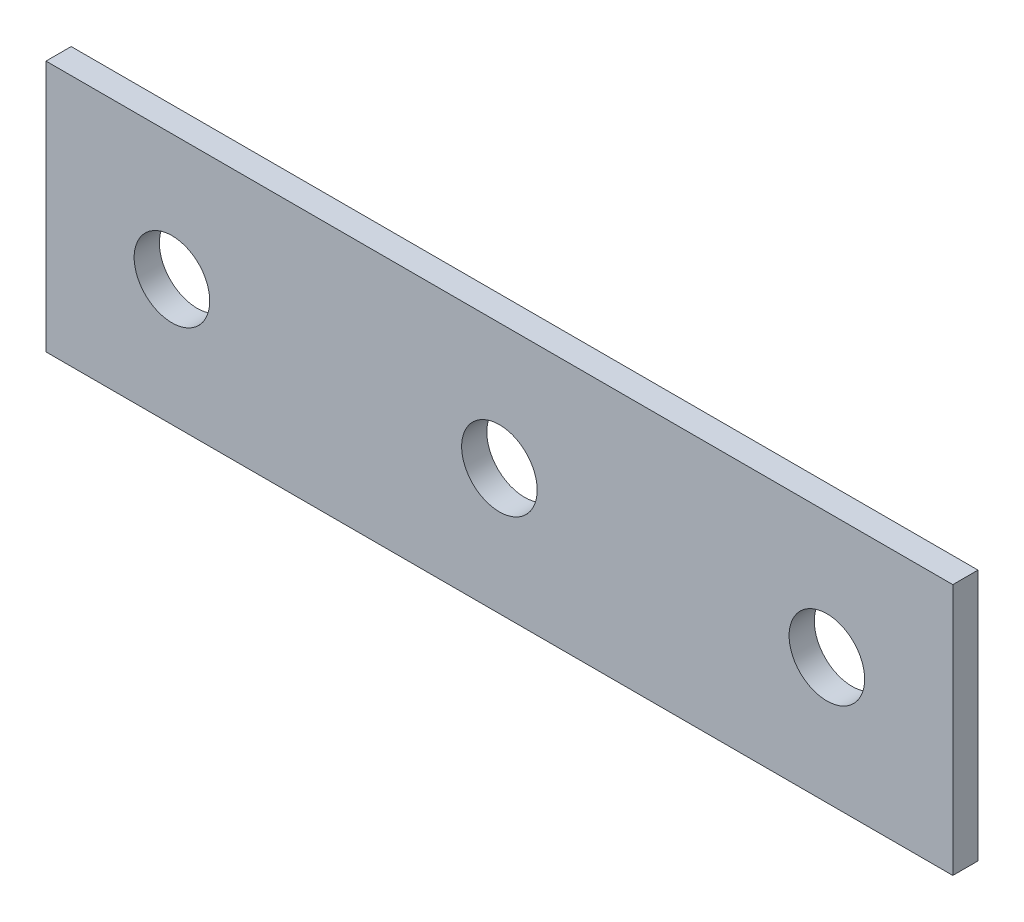
ISO-10303-21;
HEADER;
FILE_DESCRIPTION(('STEP AP214'),'2;1');
FILE_NAME('part.step','',(''),(''),'','','');
FILE_SCHEMA(('AUTOMOTIVE_DESIGN { 1 0 10303 214 1 1 1 1 }'));
ENDSEC;
DATA;
#1=APPLICATION_CONTEXT('core data for automotive mechanical design processes');
#2=APPLICATION_PROTOCOL_DEFINITION('international standard','automotive_design',2000,#1);
#3=PRODUCT_CONTEXT('',#1,'mechanical');
#4=PRODUCT('Part','Part','',(#3));
#5=PRODUCT_RELATED_PRODUCT_CATEGORY('part','',(#4));
#6=PRODUCT_DEFINITION_FORMATION('','',#4);
#7=PRODUCT_DEFINITION_CONTEXT('part definition',#1,'design');
#8=PRODUCT_DEFINITION('design','',#6,#7);
#9=PRODUCT_DEFINITION_SHAPE('','',#8);
#10=(LENGTH_UNIT() NAMED_UNIT(*) SI_UNIT(.MILLI.,.METRE.));
#11=(NAMED_UNIT(*) PLANE_ANGLE_UNIT() SI_UNIT($,.RADIAN.));
#12=(NAMED_UNIT(*) SI_UNIT($,.STERADIAN.) SOLID_ANGLE_UNIT());
#13=UNCERTAINTY_MEASURE_WITH_UNIT(LENGTH_MEASURE(1.E-05),#10,'distance_accuracy_value','');
#14=(GEOMETRIC_REPRESENTATION_CONTEXT(3) GLOBAL_UNCERTAINTY_ASSIGNED_CONTEXT((#13)) GLOBAL_UNIT_ASSIGNED_CONTEXT((#10,
#11,#12)) REPRESENTATION_CONTEXT('',''));
#15=CARTESIAN_POINT('',(0.,0.,0.));
#16=DIRECTION('',(0.,0.,1.));
#17=DIRECTION('',(1.,0.,0.));
#18=AXIS2_PLACEMENT_3D('',#15,#16,#17);
#19=CARTESIAN_POINT('',(114.3,-31.75,6.35));
#20=DIRECTION('',(-1.,0.,0.));
#21=DIRECTION('',(0.,0.,1.));
#22=AXIS2_PLACEMENT_3D('',#19,#20,#21);
#23=PLANE('',#22);
#24=DIRECTION('',(0.,1.,0.));
#25=VECTOR('',#24,1.);
#26=CARTESIAN_POINT('',(114.3,-31.75,0.));
#27=LINE('',#26,#25);
#28=CARTESIAN_POINT('',(114.3,-31.75,0.));
#29=VERTEX_POINT('',#28);
#30=CARTESIAN_POINT('',(114.3,31.75,0.));
#31=VERTEX_POINT('',#30);
#32=EDGE_CURVE('E102',#29,#31,#27,.T.);
#33=ORIENTED_EDGE('',*,*,#32,.T.);
#34=DIRECTION('',(0.,0.,-1.));
#35=VECTOR('',#34,1.);
#36=CARTESIAN_POINT('',(114.3,31.75,6.35));
#37=LINE('',#36,#35);
#38=CARTESIAN_POINT('',(114.3,31.75,6.35));
#39=VERTEX_POINT('',#38);
#40=EDGE_CURVE('E93',#39,#31,#37,.T.);
#41=ORIENTED_EDGE('',*,*,#40,.F.);
#42=DIRECTION('',(0.,1.,0.));
#43=VECTOR('',#42,1.);
#44=CARTESIAN_POINT('',(114.3,-31.75,6.35));
#45=LINE('',#44,#43);
#46=CARTESIAN_POINT('',(114.3,-31.75,6.35));
#47=VERTEX_POINT('',#46);
#48=EDGE_CURVE('E87',#47,#39,#45,.T.);
#49=ORIENTED_EDGE('',*,*,#48,.F.);
#50=DIRECTION('',(0.,0.,-1.));
#51=VECTOR('',#50,1.);
#52=CARTESIAN_POINT('',(114.3,-31.75,6.35));
#53=LINE('',#52,#51);
#54=EDGE_CURVE('E98',#47,#29,#53,.T.);
#55=ORIENTED_EDGE('',*,*,#54,.T.);
#56=EDGE_LOOP('',(#33,#41,#49,#55));
#57=FACE_BOUND('',#56,.T.);
#58=ADVANCED_FACE('F33',(#57),#23,.F.);
#59=CARTESIAN_POINT('',(-114.3,31.75,6.35));
#60=DIRECTION('',(0.,-1.,0.));
#61=DIRECTION('',(0.,0.,-1.));
#62=AXIS2_PLACEMENT_3D('',#59,#60,#61);
#63=PLANE('',#62);
#64=DIRECTION('',(-1.,0.,0.));
#65=VECTOR('',#64,1.);
#66=CARTESIAN_POINT('',(-114.3,31.75,0.));
#67=LINE('',#66,#65);
#68=CARTESIAN_POINT('',(-114.3,31.75,0.));
#69=VERTEX_POINT('',#68);
#70=EDGE_CURVE('E92',#31,#69,#67,.T.);
#71=ORIENTED_EDGE('',*,*,#70,.T.);
#72=DIRECTION('',(0.,0.,-1.));
#73=VECTOR('',#72,1.);
#74=CARTESIAN_POINT('',(-114.3,31.75,6.35));
#75=LINE('',#74,#73);
#76=CARTESIAN_POINT('',(-114.3,31.75,6.35));
#77=VERTEX_POINT('',#76);
#78=EDGE_CURVE('E90',#77,#69,#75,.T.);
#79=ORIENTED_EDGE('',*,*,#78,.F.);
#80=DIRECTION('',(-1.,0.,0.));
#81=VECTOR('',#80,1.);
#82=CARTESIAN_POINT('',(-114.3,31.75,6.35));
#83=LINE('',#82,#81);
#84=EDGE_CURVE('E81',#39,#77,#83,.T.);
#85=ORIENTED_EDGE('',*,*,#84,.F.);
#86=ORIENTED_EDGE('',*,*,#40,.T.);
#87=EDGE_LOOP('',(#71,#79,#85,#86));
#88=FACE_BOUND('',#87,.T.);
#89=ADVANCED_FACE('F91',(#88),#63,.F.);
#90=CARTESIAN_POINT('',(-114.3,-31.75,6.35));
#91=DIRECTION('',(1.,0.,0.));
#92=DIRECTION('',(0.,0.,-1.));
#93=AXIS2_PLACEMENT_3D('',#90,#91,#92);
#94=PLANE('',#93);
#95=DIRECTION('',(0.,-1.,0.));
#96=VECTOR('',#95,1.);
#97=CARTESIAN_POINT('',(-114.3,-31.75,0.));
#98=LINE('',#97,#96);
#99=CARTESIAN_POINT('',(-114.3,-31.75,0.));
#100=VERTEX_POINT('',#99);
#101=EDGE_CURVE('E67',#69,#100,#98,.T.);
#102=ORIENTED_EDGE('',*,*,#101,.T.);
#103=DIRECTION('',(0.,0.,-1.));
#104=VECTOR('',#103,1.);
#105=CARTESIAN_POINT('',(-114.3,-31.75,6.35));
#106=LINE('',#105,#104);
#107=CARTESIAN_POINT('',(-114.3,-31.75,6.35));
#108=VERTEX_POINT('',#107);
#109=EDGE_CURVE('E94',#108,#100,#106,.T.);
#110=ORIENTED_EDGE('',*,*,#109,.F.);
#111=DIRECTION('',(0.,-1.,0.));
#112=VECTOR('',#111,1.);
#113=CARTESIAN_POINT('',(-114.3,-31.75,6.35));
#114=LINE('',#113,#112);
#115=EDGE_CURVE('E85',#77,#108,#114,.T.);
#116=ORIENTED_EDGE('',*,*,#115,.F.);
#117=ORIENTED_EDGE('',*,*,#78,.T.);
#118=EDGE_LOOP('',(#102,#110,#116,#117));
#119=FACE_BOUND('',#118,.T.);
#120=ADVANCED_FACE('F96',(#119),#94,.F.);
#121=CARTESIAN_POINT('',(-114.3,-31.75,6.35));
#122=DIRECTION('',(0.,1.,0.));
#123=DIRECTION('',(0.,0.,1.));
#124=AXIS2_PLACEMENT_3D('',#121,#122,#123);
#125=PLANE('',#124);
#126=DIRECTION('',(1.,0.,0.));
#127=VECTOR('',#126,1.);
#128=CARTESIAN_POINT('',(-114.3,-31.75,0.));
#129=LINE('',#128,#127);
#130=EDGE_CURVE('E73',#100,#29,#129,.T.);
#131=ORIENTED_EDGE('',*,*,#130,.T.);
#132=ORIENTED_EDGE('',*,*,#54,.F.);
#133=DIRECTION('',(1.,0.,0.));
#134=VECTOR('',#133,1.);
#135=CARTESIAN_POINT('',(-114.3,-31.75,6.35));
#136=LINE('',#135,#134);
#137=EDGE_CURVE('E50',#108,#47,#136,.T.);
#138=ORIENTED_EDGE('',*,*,#137,.F.);
#139=ORIENTED_EDGE('',*,*,#109,.T.);
#140=EDGE_LOOP('',(#131,#132,#138,#139));
#141=FACE_BOUND('',#140,.T.);
#142=ADVANCED_FACE('F121',(#141),#125,.F.);
#143=CARTESIAN_POINT('',(114.3,31.75,6.35));
#144=DIRECTION('',(0.,0.,-1.));
#145=DIRECTION('',(-1.,0.,0.));
#146=AXIS2_PLACEMENT_3D('',#143,#144,#145);
#147=PLANE('',#146);
#148=CARTESIAN_POINT('',(0.,0.,6.35));
#149=DIRECTION('',(0.,0.,1.));
#150=DIRECTION('',(1.,0.,0.));
#151=AXIS2_PLACEMENT_3D('',#148,#149,#150);
#152=CIRCLE('',#151,9.52500000000001);
#153=CARTESIAN_POINT('',(9.52499999999999,0.,6.35));
#154=VERTEX_POINT('',#153);
#155=EDGE_CURVE('E193',#154,#154,#152,.T.);
#156=ORIENTED_EDGE('',*,*,#155,.F.);
#157=EDGE_LOOP('',(#156));
#158=FACE_BOUND('',#157,.T.);
#159=CARTESIAN_POINT('',(-82.55,0.,6.35));
#160=DIRECTION('',(0.,0.,1.));
#161=DIRECTION('',(1.,0.,0.));
#162=AXIS2_PLACEMENT_3D('',#159,#160,#161);
#163=CIRCLE('',#162,9.52500000000001);
#164=CARTESIAN_POINT('',(-73.025,0.,6.35));
#165=VERTEX_POINT('',#164);
#166=EDGE_CURVE('E194',#165,#165,#163,.T.);
#167=ORIENTED_EDGE('',*,*,#166,.F.);
#168=EDGE_LOOP('',(#167));
#169=FACE_BOUND('',#168,.T.);
#170=ORIENTED_EDGE('',*,*,#48,.T.);
#171=ORIENTED_EDGE('',*,*,#84,.T.);
#172=ORIENTED_EDGE('',*,*,#115,.T.);
#173=ORIENTED_EDGE('',*,*,#137,.T.);
#174=EDGE_LOOP('',(#170,#171,#172,#173));
#175=FACE_BOUND('',#174,.T.);
#176=CARTESIAN_POINT('',(82.55,0.,6.35));
#177=DIRECTION('',(0.,0.,1.));
#178=DIRECTION('',(1.,0.,0.));
#179=AXIS2_PLACEMENT_3D('',#176,#177,#178);
#180=CIRCLE('',#179,9.52500000000001);
#181=CARTESIAN_POINT('',(92.075,0.,6.35));
#182=VERTEX_POINT('',#181);
#183=EDGE_CURVE('E11',#182,#182,#180,.T.);
#184=ORIENTED_EDGE('',*,*,#183,.F.);
#185=EDGE_LOOP('',(#184));
#186=FACE_BOUND('',#185,.T.);
#187=ADVANCED_FACE('F82',(#158,#169,#175,#186),#147,.F.);
#188=CARTESIAN_POINT('',(114.3,31.75,0.));
#189=DIRECTION('',(0.,0.,-1.));
#190=DIRECTION('',(-1.,0.,0.));
#191=AXIS2_PLACEMENT_3D('',#188,#189,#190);
#192=PLANE('',#191);
#193=CARTESIAN_POINT('',(0.,0.,0.));
#194=DIRECTION('',(0.,0.,1.));
#195=DIRECTION('',(1.,0.,0.));
#196=AXIS2_PLACEMENT_3D('',#193,#194,#195);
#197=CIRCLE('',#196,9.52500000000001);
#198=CARTESIAN_POINT('',(9.52499999999999,0.,0.));
#199=VERTEX_POINT('',#198);
#200=EDGE_CURVE('E191',#199,#199,#197,.T.);
#201=ORIENTED_EDGE('',*,*,#200,.T.);
#202=EDGE_LOOP('',(#201));
#203=FACE_BOUND('',#202,.T.);
#204=CARTESIAN_POINT('',(-82.55,0.,0.));
#205=DIRECTION('',(0.,0.,1.));
#206=DIRECTION('',(1.,0.,0.));
#207=AXIS2_PLACEMENT_3D('',#204,#205,#206);
#208=CIRCLE('',#207,9.52500000000001);
#209=CARTESIAN_POINT('',(-73.025,0.,0.));
#210=VERTEX_POINT('',#209);
#211=EDGE_CURVE('E105',#210,#210,#208,.T.);
#212=ORIENTED_EDGE('',*,*,#211,.T.);
#213=EDGE_LOOP('',(#212));
#214=FACE_BOUND('',#213,.T.);
#215=ORIENTED_EDGE('',*,*,#32,.F.);
#216=ORIENTED_EDGE('',*,*,#130,.F.);
#217=ORIENTED_EDGE('',*,*,#101,.F.);
#218=ORIENTED_EDGE('',*,*,#70,.F.);
#219=EDGE_LOOP('',(#215,#216,#217,#218));
#220=FACE_BOUND('',#219,.T.);
#221=CARTESIAN_POINT('',(82.55,0.,0.));
#222=DIRECTION('',(0.,0.,1.));
#223=DIRECTION('',(1.,0.,0.));
#224=AXIS2_PLACEMENT_3D('',#221,#222,#223);
#225=CIRCLE('',#224,9.52500000000001);
#226=CARTESIAN_POINT('',(92.075,0.,0.));
#227=VERTEX_POINT('',#226);
#228=EDGE_CURVE('E42',#227,#227,#225,.T.);
#229=ORIENTED_EDGE('',*,*,#228,.T.);
#230=EDGE_LOOP('',(#229));
#231=FACE_BOUND('',#230,.T.);
#232=ADVANCED_FACE('F114',(#203,#214,#220,#231),#192,.T.);
#233=CARTESIAN_POINT('',(-82.55,0.,0.));
#234=DIRECTION('',(0.,0.,1.));
#235=DIRECTION('',(1.,0.,0.));
#236=AXIS2_PLACEMENT_3D('',#233,#234,#235);
#237=CYLINDRICAL_SURFACE('',#236,9.52500000000001);
#238=ORIENTED_EDGE('',*,*,#211,.F.);
#239=EDGE_LOOP('',(#238));
#240=FACE_BOUND('',#239,.T.);
#241=ORIENTED_EDGE('',*,*,#166,.T.);
#242=EDGE_LOOP('',(#241));
#243=FACE_BOUND('',#242,.T.);
#244=ADVANCED_FACE('F128',(#240,#243),#237,.F.);
#245=CARTESIAN_POINT('',(0.,0.,0.));
#246=DIRECTION('',(0.,0.,1.));
#247=DIRECTION('',(1.,0.,0.));
#248=AXIS2_PLACEMENT_3D('',#245,#246,#247);
#249=CYLINDRICAL_SURFACE('',#248,9.52500000000001);
#250=ORIENTED_EDGE('',*,*,#200,.F.);
#251=EDGE_LOOP('',(#250));
#252=FACE_BOUND('',#251,.T.);
#253=ORIENTED_EDGE('',*,*,#155,.T.);
#254=EDGE_LOOP('',(#253));
#255=FACE_BOUND('',#254,.T.);
#256=ADVANCED_FACE('F118',(#252,#255),#249,.F.);
#257=CARTESIAN_POINT('',(82.55,0.,0.));
#258=DIRECTION('',(0.,0.,1.));
#259=DIRECTION('',(1.,0.,0.));
#260=AXIS2_PLACEMENT_3D('',#257,#258,#259);
#261=CYLINDRICAL_SURFACE('',#260,9.52500000000001);
#262=ORIENTED_EDGE('',*,*,#228,.F.);
#263=EDGE_LOOP('',(#262));
#264=FACE_BOUND('',#263,.T.);
#265=ORIENTED_EDGE('',*,*,#183,.T.);
#266=EDGE_LOOP('',(#265));
#267=FACE_BOUND('',#266,.T.);
#268=ADVANCED_FACE('F35',(#264,#267),#261,.F.);
#269=CLOSED_SHELL('',(#58,#89,#120,#142,#187,#232,#244,#256,#268));
#270=MANIFOLD_SOLID_BREP('B2',#269);
#271=ADVANCED_BREP_SHAPE_REPRESENTATION('',(#18,#270),#14);
#272=SHAPE_DEFINITION_REPRESENTATION(#9,#271);
ENDSEC;
END-ISO-10303-21;
